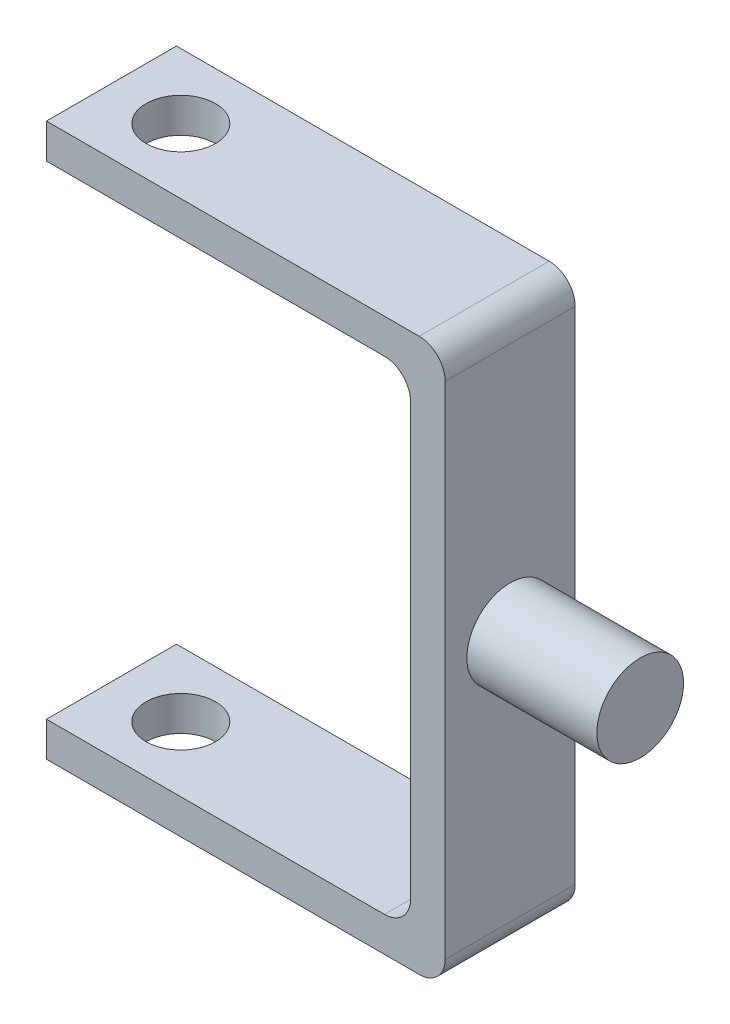
ISO-10303-21;
HEADER;
FILE_DESCRIPTION(('STEP AP214'),'2;1');
FILE_NAME('part.step','',(''),(''),'','','');
FILE_SCHEMA(('AUTOMOTIVE_DESIGN { 1 0 10303 214 1 1 1 1 }'));
ENDSEC;
DATA;
#1=APPLICATION_CONTEXT('core data for automotive mechanical design processes');
#2=APPLICATION_PROTOCOL_DEFINITION('international standard','automotive_design',2000,#1);
#3=PRODUCT_CONTEXT('',#1,'mechanical');
#4=PRODUCT('Part','Part','',(#3));
#5=PRODUCT_RELATED_PRODUCT_CATEGORY('part','',(#4));
#6=PRODUCT_DEFINITION_FORMATION('','',#4);
#7=PRODUCT_DEFINITION_CONTEXT('part definition',#1,'design');
#8=PRODUCT_DEFINITION('design','',#6,#7);
#9=PRODUCT_DEFINITION_SHAPE('','',#8);
#10=(LENGTH_UNIT() NAMED_UNIT(*) SI_UNIT(.MILLI.,.METRE.));
#11=(NAMED_UNIT(*) PLANE_ANGLE_UNIT() SI_UNIT($,.RADIAN.));
#12=(NAMED_UNIT(*) SI_UNIT($,.STERADIAN.) SOLID_ANGLE_UNIT());
#13=UNCERTAINTY_MEASURE_WITH_UNIT(LENGTH_MEASURE(1.E-05),#10,'distance_accuracy_value','');
#14=(GEOMETRIC_REPRESENTATION_CONTEXT(3) GLOBAL_UNCERTAINTY_ASSIGNED_CONTEXT((#13)) GLOBAL_UNIT_ASSIGNED_CONTEXT((#10,
#11,#12)) REPRESENTATION_CONTEXT('',''));
#15=CARTESIAN_POINT('',(0.,0.,0.));
#16=DIRECTION('',(0.,0.,1.));
#17=DIRECTION('',(1.,0.,0.));
#18=AXIS2_PLACEMENT_3D('',#15,#16,#17);
#19=CARTESIAN_POINT('',(61.,-27.8816276522917,7.5));
#20=DIRECTION('',(-1.,0.,0.));
#21=DIRECTION('',(0.,0.,1.));
#22=AXIS2_PLACEMENT_3D('',#19,#20,#21);
#23=CYLINDRICAL_SURFACE('',#22,5.);
#24=CARTESIAN_POINT('',(61.,-27.8816276522917,7.5));
#25=DIRECTION('',(1.,0.,0.));
#26=DIRECTION('',(0.,0.,-1.));
#27=AXIS2_PLACEMENT_3D('',#24,#25,#26);
#28=CIRCLE('',#27,5.);
#29=CARTESIAN_POINT('',(61.,-27.8816276522917,2.5));
#30=VERTEX_POINT('',#29);
#31=EDGE_CURVE('E261',#30,#30,#28,.T.);
#32=ORIENTED_EDGE('',*,*,#31,.F.);
#33=EDGE_LOOP('',(#32));
#34=FACE_BOUND('',#33,.T.);
#35=CARTESIAN_POINT('',(46.,-27.8816276522917,7.5));
#36=DIRECTION('',(-1.,0.,0.));
#37=DIRECTION('',(0.,-1.,0.));
#38=AXIS2_PLACEMENT_3D('',#35,#36,#37);
#39=CIRCLE('',#38,5.);
#40=CARTESIAN_POINT('',(46.,-32.8816276522917,7.5));
#41=VERTEX_POINT('',#40);
#42=EDGE_CURVE('E11',#41,#41,#39,.F.);
#43=ORIENTED_EDGE('',*,*,#42,.T.);
#44=EDGE_LOOP('',(#43));
#45=FACE_BOUND('',#44,.T.);
#46=CARTESIAN_POINT('',(53.,-27.8816276522917,2.5));
#47=CARTESIAN_POINT('',(53.0000010562445,-27.8048579228566,2.50000092453614));
#48=CARTESIAN_POINT('',(53.0029535935701,-27.7280655177734,2.50177432187729));
#49=CARTESIAN_POINT('',(53.0147142329797,-27.575079164533,2.50881637429369));
#50=CARTESIAN_POINT('',(53.0235257611882,-27.4988855929451,2.51408707446043));
#51=CARTESIAN_POINT('',(53.0586485594631,-27.2718195222671,2.53500654647451));
#52=CARTESIAN_POINT('',(53.0936477024334,-27.1226457890001,2.55576227428664));
#53=CARTESIAN_POINT('',(53.1847727435041,-26.8340859786559,2.60876761004103));
#54=CARTESIAN_POINT('',(53.2407939220127,-26.6946553848783,2.64096020448889));
#55=CARTESIAN_POINT('',(53.371720660597,-26.4275772242896,2.7140929774422));
#56=CARTESIAN_POINT('',(53.4466215323602,-26.2999267429091,2.75503098385301));
#57=CARTESIAN_POINT('',(53.6195496551151,-26.0490260484735,2.84589268716629));
#58=CARTESIAN_POINT('',(53.7189073911665,-25.9268587924301,2.89626412958105));
#59=CARTESIAN_POINT('',(53.9349344071922,-25.6998630648111,2.99939124094079));
#60=CARTESIAN_POINT('',(54.0516258742184,-25.5950571847877,3.0521499044246));
#61=CARTESIAN_POINT('',(54.3158470211689,-25.3927274571934,3.16177865166665));
#62=CARTESIAN_POINT('',(54.4654035421222,-25.2976722560133,3.21835964364203));
#63=CARTESIAN_POINT('',(54.7816931463269,-25.1343989655839,3.32123397403878));
#64=CARTESIAN_POINT('',(54.9483977920332,-25.0661373207336,3.36754395525113));
#65=CARTESIAN_POINT('',(55.2531929016569,-24.9728156065195,3.43290740622776));
#66=CARTESIAN_POINT('',(55.3884719983614,-24.9413037064154,3.45584233661355));
#67=CARTESIAN_POINT('',(55.6636074305214,-24.8973042064209,3.48819383472378));
#68=CARTESIAN_POINT('',(55.803457853304,-24.8847929534482,3.49762720910632));
#69=CARTESIAN_POINT('',(56.0840229926479,-24.8795174840935,3.50158154873749));
#70=CARTESIAN_POINT('',(56.2247388659119,-24.8867920159839,3.4960732524326));
#71=CARTESIAN_POINT('',(56.5025575351179,-24.9207064108307,3.47093477844371));
#72=CARTESIAN_POINT('',(56.6396575329415,-24.9473608400373,3.45129397865227));
#73=CARTESIAN_POINT('',(56.9050605422506,-25.0181493329598,3.40093623417071));
#74=CARTESIAN_POINT('',(57.0334543229945,-25.0620531180628,3.37036566699962));
#75=CARTESIAN_POINT('',(57.2813897666318,-25.165725977621,3.30145907296973));
#76=CARTESIAN_POINT('',(57.400928163829,-25.2255008681501,3.2631202005854));
#77=CARTESIAN_POINT('',(57.6499691376564,-25.371269914085,3.17489301634438));
#78=CARTESIAN_POINT('',(57.7775599923677,-25.4600209332731,3.1241573641925));
#79=CARTESIAN_POINT('',(58.0173491572201,-25.655798020214,3.02138977475849));
#80=CARTESIAN_POINT('',(58.1295325654021,-25.7628415589367,2.96935663922346));
#81=CARTESIAN_POINT('',(58.3512422594485,-26.0100372430782,2.86128233037086));
#82=CARTESIAN_POINT('',(58.4582193912374,-26.1527245005041,2.80569318046927));
#83=CARTESIAN_POINT('',(58.5992687127229,-26.381017115989,2.72981674004952));
#84=CARTESIAN_POINT('',(58.6430641355161,-26.4595294341349,2.70576684762532));
#85=CARTESIAN_POINT('',(58.723718823611,-26.6208839655526,2.6608350324357));
#86=CARTESIAN_POINT('',(58.7605823520208,-26.70372347728,2.63995116411037));
#87=CARTESIAN_POINT('',(58.8248114428566,-26.8678639405517,2.60317327255069));
#88=CARTESIAN_POINT('',(58.8526265604492,-26.9489375856278,2.58704899545046));
#89=CARTESIAN_POINT('',(58.9013339558453,-27.1137477025589,2.55860873205254));
#90=CARTESIAN_POINT('',(58.9222301084464,-27.1974826551171,2.54629061446715));
#91=CARTESIAN_POINT('',(58.9567718547248,-27.3668831896373,2.52583629485112));
#92=CARTESIAN_POINT('',(58.9704227558286,-27.4525473103221,2.51769703179127));
#93=CARTESIAN_POINT('',(58.9902661843902,-27.6250059056995,2.50584003585586));
#94=CARTESIAN_POINT('',(58.9964597608513,-27.711800219674,2.50212168110301));
#95=CARTESIAN_POINT('',(59.0029926702836,-27.9489519094024,2.49820842045205));
#96=CARTESIAN_POINT('',(58.9958115456306,-28.0996844949024,2.50253487428163));
#97=CARTESIAN_POINT('',(58.9591544582709,-28.3973145599207,2.52442044979933));
#98=CARTESIAN_POINT('',(58.9296789476582,-28.5442121171447,2.54197930315587));
#99=CARTESIAN_POINT('',(58.8509115408157,-28.8267702515466,2.58810552344312));
#100=CARTESIAN_POINT('',(58.802118873408,-28.9626172008612,2.61639485570267));
#101=CARTESIAN_POINT('',(58.6866456757991,-29.2241611041393,2.68172201371652));
#102=CARTESIAN_POINT('',(58.6199616174059,-29.3498560497545,2.71876156484637));
#103=CARTESIAN_POINT('',(58.462885909022,-29.6016395735933,2.80309018940722));
#104=CARTESIAN_POINT('',(58.3707523061625,-29.726415790534,2.8510439759305));
#105=CARTESIAN_POINT('',(58.1692172487452,-29.959679877774,2.95051465774129));
#106=CARTESIAN_POINT('',(58.0597957003973,-30.0681485038333,3.00203565956637));
#107=CARTESIAN_POINT('',(57.8101792085068,-30.2802675349333,3.11109153164318));
#108=CARTESIAN_POINT('',(57.667832226057,-30.3814480311335,3.16853516769846));
#109=CARTESIAN_POINT('',(57.3655679538724,-30.5585324443671,3.27567635604429));
#110=CARTESIAN_POINT('',(57.2056694128487,-30.6344629907464,3.3253820393859));
#111=CARTESIAN_POINT('',(56.9075139548893,-30.7444792258088,3.40030181570734));
#112=CARTESIAN_POINT('',(56.772039375358,-30.7840601589179,3.42848681366113));
#113=CARTESIAN_POINT('',(56.4949358437648,-30.8439009305087,3.47180788489375));
#114=CARTESIAN_POINT('',(56.3533157105485,-30.8641875562424,3.48696204672104));
#115=CARTESIAN_POINT('',(56.0672461056048,-30.8843102626338,3.50199106810078));
#116=CARTESIAN_POINT('',(55.9227880217517,-30.8840694426002,3.50180847255183));
#117=CARTESIAN_POINT('',(55.6362111256536,-30.8629571033228,3.48604564067162));
#118=CARTESIAN_POINT('',(55.4940936281252,-30.8420743659876,3.47045703176307));
#119=CARTESIAN_POINT('',(55.2230231760049,-30.7824311644141,3.42733630033783));
#120=CARTESIAN_POINT('',(55.0937658520756,-30.7445804955782,3.4004157828443));
#121=CARTESIAN_POINT('',(54.8433254503468,-30.6528923874121,3.3378899418339));
#122=CARTESIAN_POINT('',(54.722145434387,-30.5990489274689,3.30228134852515));
#123=CARTESIAN_POINT('',(54.47136046054,-30.4674130208887,3.21974027049628));
#124=CARTESIAN_POINT('',(54.3433184917852,-30.3872128346073,3.17190857420305));
#125=CARTESIAN_POINT('',(54.1012391546934,-30.2091397897613,3.07359713325945));
#126=CARTESIAN_POINT('',(53.9872134495204,-30.1112523784124,3.02311523250912));
#127=CARTESIAN_POINT('',(53.7573011566705,-29.8818311878173,2.91548761729639));
#128=CARTESIAN_POINT('',(53.6441501201384,-29.7474133701969,2.85859954261365));
#129=CARTESIAN_POINT('',(53.4417920139519,-29.4585204304261,2.75268570462041));
#130=CARTESIAN_POINT('',(53.3525935270803,-29.3040381480285,2.70366276210468));
#131=CARTESIAN_POINT('',(53.2408755258095,-29.0626495489086,2.64079441685097));
#132=CARTESIAN_POINT('',(53.2076640040355,-28.9818777951431,2.6218286081465));
#133=CARTESIAN_POINT('',(53.1482278618565,-28.8170698702801,2.58756586224796));
#134=CARTESIAN_POINT('',(53.1219991642991,-28.7330356370798,2.57226678463479));
#135=CARTESIAN_POINT('',(53.0769905579243,-28.5626294683663,2.54584472012003));
#136=CARTESIAN_POINT('',(53.0581889226967,-28.476265152901,2.53470955768049));
#137=CARTESIAN_POINT('',(53.028255644677,-28.3018113983125,2.51691681354746));
#138=CARTESIAN_POINT('',(53.0171176138467,-28.2137234590761,2.51025550276208));
#139=CARTESIAN_POINT('',(53.0066083161947,-28.0847515819531,2.50396271578522));
#140=CARTESIAN_POINT('',(53.004131569546,-28.0441839334052,2.50247801820804));
#141=CARTESIAN_POINT('',(53.0008271030861,-27.9629555304785,2.50049639830659));
#142=CARTESIAN_POINT('',(52.9999994404771,-27.9222947729189,2.49999951024677));
#143=CARTESIAN_POINT('',(53.,-27.8816276522917,2.5));
#144=B_SPLINE_CURVE_WITH_KNOTS('',3,(#46,#47,#48,#49,#50,#51,#52,#53,#54,#55,#56,#57,#58,#59,
#60,#61,#62,#63,#64,#65,#66,#67,#68,#69,#70,#71,#72,#73,#74,#75,#76,#77,#78,#79,#80,#81,#82,#83,
#84,#85,#86,#87,#88,#89,#90,#91,#92,#93,#94,#95,#96,#97,#98,#99,#100,#101,#102,#103,#104,#105,
#106,#107,#108,#109,#110,#111,#112,#113,#114,#115,#116,#117,#118,#119,#120,#121,#122,#123,#124,
#125,#126,#127,#128,#129,#130,#131,#132,#133,#134,#135,#136,#137,#138,#139,#140,#141,#142,#143),
.UNSPECIFIED.,.T.,.F.,(4,2,2,2,2,2,2,2,2,2,2,2,2,2,2,2,2,2,2,2,2,2,2,2,2,2,2,2,2,2,2,2,2,2,2,2,
2,2,2,2,2,2,2,2,2,2,2,2,4),(0.,0.230263300595005,0.460661369333402,0.922002149276127,
1.38107466343612,1.84003329022065,2.33408870888555,2.82878205293211,3.38413315803225,
3.93857770807794,4.35913349134877,4.77916531256766,5.20002031165062,5.62119195971355,
6.03692224610025,6.45280509043348,6.94139679873936,7.4304577903096,7.98767605192994,
8.26653157143432,8.54521503013735,8.80648473589064,9.06760787545944,9.32853946730962,
9.58943435026959,10.0398406663534,10.490237849174,10.9296843257003,11.3692175250854,
11.8543559282721,12.3400624135416,12.8890638604651,13.437484464234,13.8674843581987,
14.2968863865712,14.7278971274535,15.1591422350194,15.5696105785277,15.9802336423656,
16.4539008129506,16.927959499309,17.4794148474153,18.0310675325446,18.2988384573895,
18.5664526907295,18.8332781687618,19.0998809626714,19.221853785686,19.3438308395353),.UNSPECIFIED.);
#145=CARTESIAN_POINT('',(53.,-27.8816276522917,2.5));
#146=VERTEX_POINT('',#145);
#147=EDGE_CURVE('E37',#146,#146,#144,.T.);
#148=ORIENTED_EDGE('',*,*,#147,.F.);
#149=EDGE_LOOP('',(#148));
#150=FACE_BOUND('',#149,.T.);
#151=ADVANCED_FACE('F33',(#34,#45,#150),#23,.T.);
#152=CARTESIAN_POINT('',(0.,4.,15.));
#153=DIRECTION('',(1.,0.,0.));
#154=DIRECTION('',(0.,0.,-1.));
#155=AXIS2_PLACEMENT_3D('',#152,#153,#154);
#156=PLANE('',#155);
#157=DIRECTION('',(0.,-1.,0.));
#158=VECTOR('',#157,1.);
#159=CARTESIAN_POINT('',(0.,4.,0.));
#160=LINE('',#159,#158);
#161=CARTESIAN_POINT('',(0.,4.,0.));
#162=VERTEX_POINT('',#161);
#163=CARTESIAN_POINT('',(0.,0.,0.));
#164=VERTEX_POINT('',#163);
#165=EDGE_CURVE('E154',#162,#164,#160,.T.);
#166=ORIENTED_EDGE('',*,*,#165,.T.);
#167=DIRECTION('',(0.,0.,-1.));
#168=VECTOR('',#167,1.);
#169=CARTESIAN_POINT('',(0.,0.,15.));
#170=LINE('',#169,#168);
#171=CARTESIAN_POINT('',(0.,0.,15.));
#172=VERTEX_POINT('',#171);
#173=EDGE_CURVE('E136',#172,#164,#170,.T.);
#174=ORIENTED_EDGE('',*,*,#173,.F.);
#175=DIRECTION('',(0.,-1.,0.));
#176=VECTOR('',#175,1.);
#177=CARTESIAN_POINT('',(0.,4.,15.));
#178=LINE('',#177,#176);
#179=CARTESIAN_POINT('',(0.,4.,15.));
#180=VERTEX_POINT('',#179);
#181=EDGE_CURVE('E142',#180,#172,#178,.T.);
#182=ORIENTED_EDGE('',*,*,#181,.F.);
#183=DIRECTION('',(0.,0.,-1.));
#184=VECTOR('',#183,1.);
#185=CARTESIAN_POINT('',(0.,4.,15.));
#186=LINE('',#185,#184);
#187=EDGE_CURVE('E227',#180,#162,#186,.T.);
#188=ORIENTED_EDGE('',*,*,#187,.T.);
#189=EDGE_LOOP('',(#166,#174,#182,#188));
#190=FACE_BOUND('',#189,.T.);
#191=ADVANCED_FACE('F152',(#190),#156,.F.);
#192=CARTESIAN_POINT('',(0.,0.,15.));
#193=DIRECTION('',(0.,1.,0.));
#194=DIRECTION('',(0.,0.,1.));
#195=AXIS2_PLACEMENT_3D('',#192,#193,#194);
#196=PLANE('',#195);
#197=CARTESIAN_POINT('',(8.,0.,7.5));
#198=DIRECTION('',(0.,1.,0.));
#199=DIRECTION('',(0.,0.,1.));
#200=AXIS2_PLACEMENT_3D('',#197,#198,#199);
#201=CIRCLE('',#200,4.);
#202=CARTESIAN_POINT('',(8.,0.,11.5));
#203=VERTEX_POINT('',#202);
#204=EDGE_CURVE('E214',#203,#203,#201,.T.);
#205=ORIENTED_EDGE('',*,*,#204,.T.);
#206=EDGE_LOOP('',(#205));
#207=FACE_BOUND('',#206,.T.);
#208=DIRECTION('',(1.,0.,0.));
#209=VECTOR('',#208,1.);
#210=CARTESIAN_POINT('',(0.,0.,0.));
#211=LINE('',#210,#209);
#212=CARTESIAN_POINT('',(39.,0.,0.));
#213=VERTEX_POINT('',#212);
#214=EDGE_CURVE('E209',#164,#213,#211,.T.);
#215=ORIENTED_EDGE('',*,*,#214,.T.);
#216=DIRECTION('',(0.,0.,-1.));
#217=VECTOR('',#216,1.);
#218=CARTESIAN_POINT('',(39.,0.,15.));
#219=LINE('',#218,#217);
#220=CARTESIAN_POINT('',(39.,0.,15.));
#221=VERTEX_POINT('',#220);
#222=EDGE_CURVE('E139',#213,#221,#219,.F.);
#223=ORIENTED_EDGE('',*,*,#222,.T.);
#224=DIRECTION('',(1.,0.,0.));
#225=VECTOR('',#224,1.);
#226=CARTESIAN_POINT('',(0.,0.,15.));
#227=LINE('',#226,#225);
#228=EDGE_CURVE('E131',#172,#221,#227,.T.);
#229=ORIENTED_EDGE('',*,*,#228,.F.);
#230=ORIENTED_EDGE('',*,*,#173,.T.);
#231=EDGE_LOOP('',(#215,#223,#229,#230));
#232=FACE_BOUND('',#231,.T.);
#233=ADVANCED_FACE('F134',(#207,#232),#196,.F.);
#234=CARTESIAN_POINT('',(42.,0.,15.));
#235=DIRECTION('',(1.,0.,0.));
#236=DIRECTION('',(0.,1.,0.));
#237=AXIS2_PLACEMENT_3D('',#234,#235,#236);
#238=PLANE('',#237);
#239=DIRECTION('',(0.,-1.,0.));
#240=VECTOR('',#239,1.);
#241=CARTESIAN_POINT('',(42.,0.,0.));
#242=LINE('',#241,#240);
#243=CARTESIAN_POINT('',(42.,-3.,0.));
#244=VERTEX_POINT('',#243);
#245=CARTESIAN_POINT('',(42.,-52.7632553045835,0.));
#246=VERTEX_POINT('',#245);
#247=EDGE_CURVE('E210',#244,#246,#242,.T.);
#248=ORIENTED_EDGE('',*,*,#247,.T.);
#249=DIRECTION('',(0.,0.,-1.));
#250=VECTOR('',#249,1.);
#251=CARTESIAN_POINT('',(42.,-52.7632553045835,15.));
#252=LINE('',#251,#250);
#253=CARTESIAN_POINT('',(42.,-52.7632553045835,15.));
#254=VERTEX_POINT('',#253);
#255=EDGE_CURVE('E168',#246,#254,#252,.F.);
#256=ORIENTED_EDGE('',*,*,#255,.T.);
#257=DIRECTION('',(0.,-1.,0.));
#258=VECTOR('',#257,1.);
#259=CARTESIAN_POINT('',(42.,0.,15.));
#260=LINE('',#259,#258);
#261=CARTESIAN_POINT('',(42.,-3.,15.));
#262=VERTEX_POINT('',#261);
#263=EDGE_CURVE('E141',#262,#254,#260,.T.);
#264=ORIENTED_EDGE('',*,*,#263,.F.);
#265=DIRECTION('',(0.,0.,-1.));
#266=VECTOR('',#265,1.);
#267=CARTESIAN_POINT('',(42.,-3.,0.));
#268=LINE('',#267,#266);
#269=EDGE_CURVE('E159',#262,#244,#268,.T.);
#270=ORIENTED_EDGE('',*,*,#269,.T.);
#271=EDGE_LOOP('',(#248,#256,#264,#270));
#272=FACE_BOUND('',#271,.T.);
#273=ADVANCED_FACE('F200',(#272),#238,.F.);
#274=CARTESIAN_POINT('',(42.,-55.7632553045835,15.));
#275=DIRECTION('',(0.,-1.,0.));
#276=DIRECTION('',(1.,0.,0.));
#277=AXIS2_PLACEMENT_3D('',#274,#275,#276);
#278=PLANE('',#277);
#279=CARTESIAN_POINT('',(8.,-55.7632553045835,7.5));
#280=DIRECTION('',(0.,-1.,0.));
#281=DIRECTION('',(1.,0.,0.));
#282=AXIS2_PLACEMENT_3D('',#279,#280,#281);
#283=CIRCLE('',#282,4.);
#284=CARTESIAN_POINT('',(12.,-55.7632553045835,7.5));
#285=VERTEX_POINT('',#284);
#286=EDGE_CURVE('E254',#285,#285,#283,.T.);
#287=ORIENTED_EDGE('',*,*,#286,.T.);
#288=EDGE_LOOP('',(#287));
#289=FACE_BOUND('',#288,.T.);
#290=DIRECTION('',(-1.,0.,0.));
#291=VECTOR('',#290,1.);
#292=CARTESIAN_POINT('',(42.,-55.7632553045835,15.));
#293=LINE('',#292,#291);
#294=CARTESIAN_POINT('',(39.,-55.7632553045835,15.));
#295=VERTEX_POINT('',#294);
#296=CARTESIAN_POINT('',(0.,-55.7632553045835,15.));
#297=VERTEX_POINT('',#296);
#298=EDGE_CURVE('E203',#295,#297,#293,.T.);
#299=ORIENTED_EDGE('',*,*,#298,.F.);
#300=DIRECTION('',(0.,0.,-1.));
#301=VECTOR('',#300,1.);
#302=CARTESIAN_POINT('',(39.,-55.7632553045835,0.));
#303=LINE('',#302,#301);
#304=CARTESIAN_POINT('',(39.,-55.7632553045835,0.));
#305=VERTEX_POINT('',#304);
#306=EDGE_CURVE('E155',#295,#305,#303,.T.);
#307=ORIENTED_EDGE('',*,*,#306,.T.);
#308=DIRECTION('',(-1.,0.,0.));
#309=VECTOR('',#308,1.);
#310=CARTESIAN_POINT('',(42.,-55.7632553045835,0.));
#311=LINE('',#310,#309);
#312=CARTESIAN_POINT('',(0.,-55.7632553045835,0.));
#313=VERTEX_POINT('',#312);
#314=EDGE_CURVE('E212',#305,#313,#311,.T.);
#315=ORIENTED_EDGE('',*,*,#314,.T.);
#316=DIRECTION('',(0.,0.,-1.));
#317=VECTOR('',#316,1.);
#318=CARTESIAN_POINT('',(0.,-55.7632553045835,15.));
#319=LINE('',#318,#317);
#320=EDGE_CURVE('E156',#297,#313,#319,.T.);
#321=ORIENTED_EDGE('',*,*,#320,.F.);
#322=EDGE_LOOP('',(#299,#307,#315,#321));
#323=FACE_BOUND('',#322,.T.);
#324=ADVANCED_FACE('F309',(#289,#323),#278,.F.);
#325=CARTESIAN_POINT('',(0.,-55.7632553045835,15.));
#326=DIRECTION('',(1.,0.,0.));
#327=DIRECTION('',(0.,1.,0.));
#328=AXIS2_PLACEMENT_3D('',#325,#326,#327);
#329=PLANE('',#328);
#330=DIRECTION('',(0.,-1.,0.));
#331=VECTOR('',#330,1.);
#332=CARTESIAN_POINT('',(0.,-55.7632553045835,0.));
#333=LINE('',#332,#331);
#334=CARTESIAN_POINT('',(0.,-59.7632553045835,0.));
#335=VERTEX_POINT('',#334);
#336=EDGE_CURVE('E219',#313,#335,#333,.T.);
#337=ORIENTED_EDGE('',*,*,#336,.T.);
#338=DIRECTION('',(0.,0.,-1.));
#339=VECTOR('',#338,1.);
#340=CARTESIAN_POINT('',(0.,-59.7632553045835,15.));
#341=LINE('',#340,#339);
#342=CARTESIAN_POINT('',(0.,-59.7632553045835,15.));
#343=VERTEX_POINT('',#342);
#344=EDGE_CURVE('E162',#343,#335,#341,.T.);
#345=ORIENTED_EDGE('',*,*,#344,.F.);
#346=DIRECTION('',(0.,-1.,0.));
#347=VECTOR('',#346,1.);
#348=CARTESIAN_POINT('',(0.,-55.7632553045835,15.));
#349=LINE('',#348,#347);
#350=EDGE_CURVE('E247',#297,#343,#349,.T.);
#351=ORIENTED_EDGE('',*,*,#350,.F.);
#352=ORIENTED_EDGE('',*,*,#320,.T.);
#353=EDGE_LOOP('',(#337,#345,#351,#352));
#354=FACE_BOUND('',#353,.T.);
#355=ADVANCED_FACE('F305',(#354),#329,.F.);
#356=CARTESIAN_POINT('',(46.,-59.7632553045835,15.));
#357=DIRECTION('',(0.,1.,0.));
#358=DIRECTION('',(0.,0.,1.));
#359=AXIS2_PLACEMENT_3D('',#356,#357,#358);
#360=PLANE('',#359);
#361=CARTESIAN_POINT('',(8.,-59.7632553045835,7.5));
#362=DIRECTION('',(0.,1.,0.));
#363=DIRECTION('',(0.,0.,1.));
#364=AXIS2_PLACEMENT_3D('',#361,#362,#363);
#365=CIRCLE('',#364,4.);
#366=CARTESIAN_POINT('',(8.,-59.7632553045835,11.5));
#367=VERTEX_POINT('',#366);
#368=EDGE_CURVE('E257',#367,#367,#365,.T.);
#369=ORIENTED_EDGE('',*,*,#368,.T.);
#370=EDGE_LOOP('',(#369));
#371=FACE_BOUND('',#370,.T.);
#372=DIRECTION('',(1.,0.,0.));
#373=VECTOR('',#372,1.);
#374=CARTESIAN_POINT('',(46.,-59.7632553045835,0.));
#375=LINE('',#374,#373);
#376=CARTESIAN_POINT('',(43.,-59.7632553045835,0.));
#377=VERTEX_POINT('',#376);
#378=EDGE_CURVE('E221',#335,#377,#375,.T.);
#379=ORIENTED_EDGE('',*,*,#378,.T.);
#380=DIRECTION('',(0.,0.,-1.));
#381=VECTOR('',#380,1.);
#382=CARTESIAN_POINT('',(43.,-59.7632553045835,15.));
#383=LINE('',#382,#381);
#384=CARTESIAN_POINT('',(43.,-59.7632553045835,15.));
#385=VERTEX_POINT('',#384);
#386=EDGE_CURVE('E62',#377,#385,#383,.F.);
#387=ORIENTED_EDGE('',*,*,#386,.T.);
#388=DIRECTION('',(1.,0.,0.));
#389=VECTOR('',#388,1.);
#390=CARTESIAN_POINT('',(46.,-59.7632553045835,15.));
#391=LINE('',#390,#389);
#392=EDGE_CURVE('E232',#343,#385,#391,.T.);
#393=ORIENTED_EDGE('',*,*,#392,.F.);
#394=ORIENTED_EDGE('',*,*,#344,.T.);
#395=EDGE_LOOP('',(#379,#387,#393,#394));
#396=FACE_BOUND('',#395,.T.);
#397=ADVANCED_FACE('F231',(#371,#396),#360,.F.);
#398=CARTESIAN_POINT('',(46.,4.,15.));
#399=DIRECTION('',(-1.,0.,0.));
#400=DIRECTION('',(0.,-1.,0.));
#401=AXIS2_PLACEMENT_3D('',#398,#399,#400);
#402=PLANE('',#401);
#403=ORIENTED_EDGE('',*,*,#42,.F.);
#404=EDGE_LOOP('',(#403));
#405=FACE_BOUND('',#404,.T.);
#406=DIRECTION('',(0.,1.,0.));
#407=VECTOR('',#406,1.);
#408=CARTESIAN_POINT('',(46.,4.,15.));
#409=LINE('',#408,#407);
#410=CARTESIAN_POINT('',(46.,-56.7632553045835,15.));
#411=VERTEX_POINT('',#410);
#412=CARTESIAN_POINT('',(46.,1.,15.));
#413=VERTEX_POINT('',#412);
#414=EDGE_CURVE('E245',#411,#413,#409,.T.);
#415=ORIENTED_EDGE('',*,*,#414,.F.);
#416=DIRECTION('',(0.,0.,-1.));
#417=VECTOR('',#416,1.);
#418=CARTESIAN_POINT('',(46.,-56.7632553045835,15.));
#419=LINE('',#418,#417);
#420=CARTESIAN_POINT('',(46.,-56.7632553045835,0.));
#421=VERTEX_POINT('',#420);
#422=EDGE_CURVE('E173',#411,#421,#419,.T.);
#423=ORIENTED_EDGE('',*,*,#422,.T.);
#424=DIRECTION('',(0.,1.,0.));
#425=VECTOR('',#424,1.);
#426=CARTESIAN_POINT('',(46.,4.,0.));
#427=LINE('',#426,#425);
#428=CARTESIAN_POINT('',(46.,1.,0.));
#429=VERTEX_POINT('',#428);
#430=EDGE_CURVE('E223',#421,#429,#427,.T.);
#431=ORIENTED_EDGE('',*,*,#430,.T.);
#432=DIRECTION('',(0.,0.,-1.));
#433=VECTOR('',#432,1.);
#434=CARTESIAN_POINT('',(46.,1.,15.));
#435=LINE('',#434,#433);
#436=EDGE_CURVE('E171',#429,#413,#435,.F.);
#437=ORIENTED_EDGE('',*,*,#436,.T.);
#438=EDGE_LOOP('',(#415,#423,#431,#437));
#439=FACE_BOUND('',#438,.T.);
#440=ADVANCED_FACE('F243',(#405,#439),#402,.F.);
#441=CARTESIAN_POINT('',(0.,4.,15.));
#442=DIRECTION('',(0.,-1.,0.));
#443=DIRECTION('',(0.,0.,-1.));
#444=AXIS2_PLACEMENT_3D('',#441,#442,#443);
#445=PLANE('',#444);
#446=CARTESIAN_POINT('',(8.,4.,7.5));
#447=DIRECTION('',(0.,1.,0.));
#448=DIRECTION('',(0.,0.,1.));
#449=AXIS2_PLACEMENT_3D('',#446,#447,#448);
#450=CIRCLE('',#449,4.);
#451=CARTESIAN_POINT('',(8.,4.,11.5));
#452=VERTEX_POINT('',#451);
#453=EDGE_CURVE('E258',#452,#452,#450,.T.);
#454=ORIENTED_EDGE('',*,*,#453,.F.);
#455=EDGE_LOOP('',(#454));
#456=FACE_BOUND('',#455,.T.);
#457=DIRECTION('',(-1.,0.,0.));
#458=VECTOR('',#457,1.);
#459=CARTESIAN_POINT('',(0.,4.,15.));
#460=LINE('',#459,#458);
#461=CARTESIAN_POINT('',(43.,4.,15.));
#462=VERTEX_POINT('',#461);
#463=EDGE_CURVE('E146',#462,#180,#460,.T.);
#464=ORIENTED_EDGE('',*,*,#463,.F.);
#465=DIRECTION('',(0.,0.,-1.));
#466=VECTOR('',#465,1.);
#467=CARTESIAN_POINT('',(43.,4.,15.));
#468=LINE('',#467,#466);
#469=CARTESIAN_POINT('',(43.,4.,0.));
#470=VERTEX_POINT('',#469);
#471=EDGE_CURVE('E184',#462,#470,#468,.T.);
#472=ORIENTED_EDGE('',*,*,#471,.T.);
#473=DIRECTION('',(-1.,0.,0.));
#474=VECTOR('',#473,1.);
#475=CARTESIAN_POINT('',(0.,4.,0.));
#476=LINE('',#475,#474);
#477=EDGE_CURVE('E150',#470,#162,#476,.T.);
#478=ORIENTED_EDGE('',*,*,#477,.T.);
#479=ORIENTED_EDGE('',*,*,#187,.F.);
#480=EDGE_LOOP('',(#464,#472,#478,#479));
#481=FACE_BOUND('',#480,.T.);
#482=ADVANCED_FACE('F294',(#456,#481),#445,.F.);
#483=CARTESIAN_POINT('',(0.,0.,15.));
#484=DIRECTION('',(0.,0.,1.));
#485=DIRECTION('',(1.,0.,0.));
#486=AXIS2_PLACEMENT_3D('',#483,#484,#485);
#487=PLANE('',#486);
#488=ORIENTED_EDGE('',*,*,#392,.T.);
#489=CARTESIAN_POINT('',(43.,-56.7632553045835,15.));
#490=DIRECTION('',(0.,0.,1.));
#491=DIRECTION('',(1.,0.,0.));
#492=AXIS2_PLACEMENT_3D('',#489,#490,#491);
#493=CIRCLE('',#492,3.);
#494=EDGE_CURVE('E182',#385,#411,#493,.T.);
#495=ORIENTED_EDGE('',*,*,#494,.T.);
#496=ORIENTED_EDGE('',*,*,#414,.T.);
#497=CARTESIAN_POINT('',(43.,1.,15.));
#498=DIRECTION('',(0.,0.,1.));
#499=DIRECTION('',(1.,0.,0.));
#500=AXIS2_PLACEMENT_3D('',#497,#498,#499);
#501=CIRCLE('',#500,3.);
#502=EDGE_CURVE('E54',#413,#462,#501,.T.);
#503=ORIENTED_EDGE('',*,*,#502,.T.);
#504=ORIENTED_EDGE('',*,*,#463,.T.);
#505=ORIENTED_EDGE('',*,*,#181,.T.);
#506=ORIENTED_EDGE('',*,*,#228,.T.);
#507=CARTESIAN_POINT('',(39.,-3.,15.));
#508=DIRECTION('',(0.,0.,1.));
#509=DIRECTION('',(1.,0.,0.));
#510=AXIS2_PLACEMENT_3D('',#507,#508,#509);
#511=CIRCLE('',#510,3.);
#512=EDGE_CURVE('E47',#221,#262,#511,.F.);
#513=ORIENTED_EDGE('',*,*,#512,.T.);
#514=ORIENTED_EDGE('',*,*,#263,.T.);
#515=CARTESIAN_POINT('',(39.,-52.7632553045835,15.));
#516=DIRECTION('',(0.,0.,1.));
#517=DIRECTION('',(1.,0.,0.));
#518=AXIS2_PLACEMENT_3D('',#515,#516,#517);
#519=CIRCLE('',#518,3.);
#520=EDGE_CURVE('E189',#254,#295,#519,.F.);
#521=ORIENTED_EDGE('',*,*,#520,.T.);
#522=ORIENTED_EDGE('',*,*,#298,.T.);
#523=ORIENTED_EDGE('',*,*,#350,.T.);
#524=EDGE_LOOP('',(#488,#495,#496,#503,#504,#505,#506,#513,#514,#521,#522,#523));
#525=FACE_BOUND('',#524,.T.);
#526=ADVANCED_FACE('F145',(#525),#487,.T.);
#527=CARTESIAN_POINT('',(0.,0.,0.));
#528=DIRECTION('',(0.,0.,1.));
#529=DIRECTION('',(1.,0.,0.));
#530=AXIS2_PLACEMENT_3D('',#527,#528,#529);
#531=PLANE('',#530);
#532=ORIENTED_EDGE('',*,*,#430,.F.);
#533=CARTESIAN_POINT('',(43.,-56.7632553045835,0.));
#534=DIRECTION('',(0.,0.,1.));
#535=DIRECTION('',(1.,0.,0.));
#536=AXIS2_PLACEMENT_3D('',#533,#534,#535);
#537=CIRCLE('',#536,3.);
#538=EDGE_CURVE('E178',#421,#377,#537,.F.);
#539=ORIENTED_EDGE('',*,*,#538,.T.);
#540=ORIENTED_EDGE('',*,*,#378,.F.);
#541=ORIENTED_EDGE('',*,*,#336,.F.);
#542=ORIENTED_EDGE('',*,*,#314,.F.);
#543=CARTESIAN_POINT('',(39.,-52.7632553045835,0.));
#544=DIRECTION('',(0.,0.,1.));
#545=DIRECTION('',(1.,0.,0.));
#546=AXIS2_PLACEMENT_3D('',#543,#544,#545);
#547=CIRCLE('',#546,3.);
#548=EDGE_CURVE('E187',#305,#246,#547,.T.);
#549=ORIENTED_EDGE('',*,*,#548,.T.);
#550=ORIENTED_EDGE('',*,*,#247,.F.);
#551=CARTESIAN_POINT('',(39.,-3.,0.));
#552=DIRECTION('',(0.,0.,1.));
#553=DIRECTION('',(1.,0.,0.));
#554=AXIS2_PLACEMENT_3D('',#551,#552,#553);
#555=CIRCLE('',#554,3.);
#556=EDGE_CURVE('E191',#244,#213,#555,.T.);
#557=ORIENTED_EDGE('',*,*,#556,.T.);
#558=ORIENTED_EDGE('',*,*,#214,.F.);
#559=ORIENTED_EDGE('',*,*,#165,.F.);
#560=ORIENTED_EDGE('',*,*,#477,.F.);
#561=CARTESIAN_POINT('',(43.,1.,0.));
#562=DIRECTION('',(0.,0.,1.));
#563=DIRECTION('',(1.,0.,0.));
#564=AXIS2_PLACEMENT_3D('',#561,#562,#563);
#565=CIRCLE('',#564,3.);
#566=EDGE_CURVE('E176',#470,#429,#565,.F.);
#567=ORIENTED_EDGE('',*,*,#566,.T.);
#568=EDGE_LOOP('',(#532,#539,#540,#541,#542,#549,#550,#557,#558,#559,#560,#567));
#569=FACE_BOUND('',#568,.T.);
#570=ADVANCED_FACE('F208',(#569),#531,.F.);
#571=CARTESIAN_POINT('',(8.,-59.7632553045835,7.5));
#572=DIRECTION('',(0.,1.,0.));
#573=DIRECTION('',(0.,0.,1.));
#574=AXIS2_PLACEMENT_3D('',#571,#572,#573);
#575=CYLINDRICAL_SURFACE('',#574,4.);
#576=ORIENTED_EDGE('',*,*,#453,.T.);
#577=EDGE_LOOP('',(#576));
#578=FACE_BOUND('',#577,.T.);
#579=ORIENTED_EDGE('',*,*,#204,.F.);
#580=EDGE_LOOP('',(#579));
#581=FACE_BOUND('',#580,.T.);
#582=ADVANCED_FACE('F287',(#578,#581),#575,.F.);
#583=ORIENTED_EDGE('',*,*,#368,.F.);
#584=EDGE_LOOP('',(#583));
#585=FACE_BOUND('',#584,.T.);
#586=ORIENTED_EDGE('',*,*,#286,.F.);
#587=EDGE_LOOP('',(#586));
#588=FACE_BOUND('',#587,.T.);
#589=ADVANCED_FACE('F290',(#585,#588),#575,.F.);
#590=CARTESIAN_POINT('',(39.,-52.7632553045835,15.));
#591=DIRECTION('',(0.,0.,1.));
#592=DIRECTION('',(1.,0.,0.));
#593=AXIS2_PLACEMENT_3D('',#590,#591,#592);
#594=CYLINDRICAL_SURFACE('',#593,3.);
#595=ORIENTED_EDGE('',*,*,#520,.F.);
#596=ORIENTED_EDGE('',*,*,#255,.F.);
#597=ORIENTED_EDGE('',*,*,#548,.F.);
#598=ORIENTED_EDGE('',*,*,#306,.F.);
#599=EDGE_LOOP('',(#595,#596,#597,#598));
#600=FACE_BOUND('',#599,.T.);
#601=ADVANCED_FACE('F318',(#600),#594,.F.);
#602=CARTESIAN_POINT('',(39.,-3.,15.));
#603=DIRECTION('',(0.,0.,1.));
#604=DIRECTION('',(1.,0.,0.));
#605=AXIS2_PLACEMENT_3D('',#602,#603,#604);
#606=CYLINDRICAL_SURFACE('',#605,3.);
#607=ORIENTED_EDGE('',*,*,#512,.F.);
#608=ORIENTED_EDGE('',*,*,#222,.F.);
#609=ORIENTED_EDGE('',*,*,#556,.F.);
#610=ORIENTED_EDGE('',*,*,#269,.F.);
#611=EDGE_LOOP('',(#607,#608,#609,#610));
#612=FACE_BOUND('',#611,.T.);
#613=ADVANCED_FACE('F205',(#612),#606,.F.);
#614=CARTESIAN_POINT('',(43.,-56.7632553045835,15.));
#615=DIRECTION('',(0.,0.,-1.));
#616=DIRECTION('',(-1.,0.,0.));
#617=AXIS2_PLACEMENT_3D('',#614,#615,#616);
#618=CYLINDRICAL_SURFACE('',#617,3.);
#619=ORIENTED_EDGE('',*,*,#494,.F.);
#620=ORIENTED_EDGE('',*,*,#386,.F.);
#621=ORIENTED_EDGE('',*,*,#538,.F.);
#622=ORIENTED_EDGE('',*,*,#422,.F.);
#623=EDGE_LOOP('',(#619,#620,#621,#622));
#624=FACE_BOUND('',#623,.T.);
#625=ADVANCED_FACE('F240',(#624),#618,.T.);
#626=CARTESIAN_POINT('',(43.,1.,15.));
#627=DIRECTION('',(0.,0.,-1.));
#628=DIRECTION('',(-1.,0.,0.));
#629=AXIS2_PLACEMENT_3D('',#626,#627,#628);
#630=CYLINDRICAL_SURFACE('',#629,3.);
#631=ORIENTED_EDGE('',*,*,#502,.F.);
#632=ORIENTED_EDGE('',*,*,#436,.F.);
#633=ORIENTED_EDGE('',*,*,#566,.F.);
#634=ORIENTED_EDGE('',*,*,#471,.F.);
#635=EDGE_LOOP('',(#631,#632,#633,#634));
#636=FACE_BOUND('',#635,.T.);
#637=ADVANCED_FACE('F35',(#636),#630,.T.);
#638=CARTESIAN_POINT('',(61.,-27.8816276522917,7.5));
#639=DIRECTION('',(1.,0.,0.));
#640=DIRECTION('',(0.,0.,-1.));
#641=AXIS2_PLACEMENT_3D('',#638,#639,#640);
#642=PLANE('',#641);
#643=ORIENTED_EDGE('',*,*,#31,.T.);
#644=EDGE_LOOP('',(#643));
#645=FACE_BOUND('',#644,.T.);
#646=ADVANCED_FACE('F286',(#645),#642,.T.);
#647=CARTESIAN_POINT('',(56.,-27.8816276522917,7.));
#648=DIRECTION('',(0.,0.,-1.));
#649=DIRECTION('',(-1.,0.,0.));
#650=AXIS2_PLACEMENT_3D('',#647,#648,#649);
#651=CYLINDRICAL_SURFACE('',#650,3.);
#652=CARTESIAN_POINT('',(56.,-27.8816276522917,7.));
#653=DIRECTION('',(0.,0.,1.));
#654=DIRECTION('',(1.,0.,0.));
#655=AXIS2_PLACEMENT_3D('',#652,#653,#654);
#656=CIRCLE('',#655,3.);
#657=CARTESIAN_POINT('',(59.,-27.8816276522917,7.));
#658=VERTEX_POINT('',#657);
#659=EDGE_CURVE('E266',#658,#658,#656,.T.);
#660=ORIENTED_EDGE('',*,*,#659,.T.);
#661=EDGE_LOOP('',(#660));
#662=FACE_BOUND('',#661,.T.);
#663=ORIENTED_EDGE('',*,*,#147,.T.);
#664=EDGE_LOOP('',(#663));
#665=FACE_BOUND('',#664,.T.);
#666=ADVANCED_FACE('F273',(#662,#665),#651,.F.);
#667=CARTESIAN_POINT('',(56.,-27.8816276522917,7.));
#668=DIRECTION('',(0.,0.,1.));
#669=DIRECTION('',(1.,0.,0.));
#670=AXIS2_PLACEMENT_3D('',#667,#668,#669);
#671=PLANE('',#670);
#672=ORIENTED_EDGE('',*,*,#659,.F.);
#673=EDGE_LOOP('',(#672));
#674=FACE_BOUND('',#673,.T.);
#675=ADVANCED_FACE('F338',(#674),#671,.F.);
#676=CLOSED_SHELL('',(#151,#191,#233,#273,#324,#355,#397,#440,#482,#526,#570,#582,#589,#601,
#613,#625,#637,#646,#666,#675));
#677=MANIFOLD_SOLID_BREP('B2',#676);
#678=ADVANCED_BREP_SHAPE_REPRESENTATION('',(#18,#677),#14);
#679=SHAPE_DEFINITION_REPRESENTATION(#9,#678);
ENDSEC;
END-ISO-10303-21;
